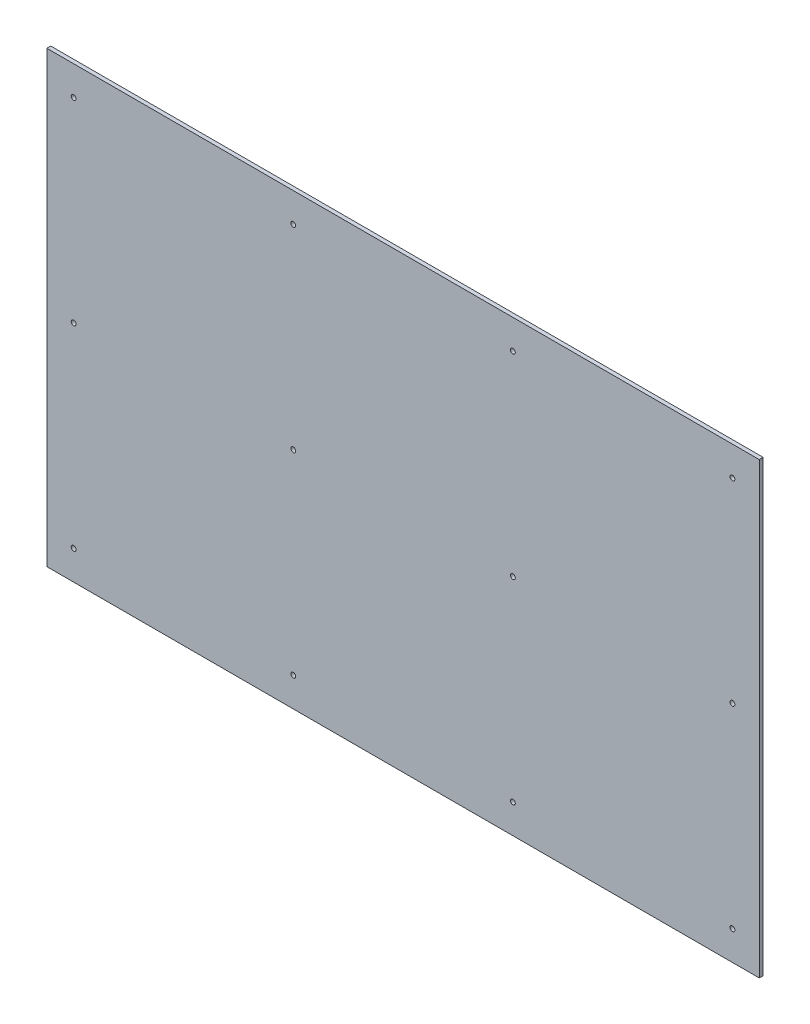
ISO-10303-21;
HEADER;
FILE_DESCRIPTION(('STEP AP214'),'2;1');
FILE_NAME('part.step','',(''),(''),'','','');
FILE_SCHEMA(('AUTOMOTIVE_DESIGN { 1 0 10303 214 1 1 1 1 }'));
ENDSEC;
DATA;
#1=APPLICATION_CONTEXT('core data for automotive mechanical design processes');
#2=APPLICATION_PROTOCOL_DEFINITION('international standard','automotive_design',2000,#1);
#3=PRODUCT_CONTEXT('',#1,'mechanical');
#4=PRODUCT('Part','Part','',(#3));
#5=PRODUCT_RELATED_PRODUCT_CATEGORY('part','',(#4));
#6=PRODUCT_DEFINITION_FORMATION('','',#4);
#7=PRODUCT_DEFINITION_CONTEXT('part definition',#1,'design');
#8=PRODUCT_DEFINITION('design','',#6,#7);
#9=PRODUCT_DEFINITION_SHAPE('','',#8);
#10=(LENGTH_UNIT() NAMED_UNIT(*) SI_UNIT(.MILLI.,.METRE.));
#11=(NAMED_UNIT(*) PLANE_ANGLE_UNIT() SI_UNIT($,.RADIAN.));
#12=(NAMED_UNIT(*) SI_UNIT($,.STERADIAN.) SOLID_ANGLE_UNIT());
#13=UNCERTAINTY_MEASURE_WITH_UNIT(LENGTH_MEASURE(1.E-05),#10,'distance_accuracy_value','');
#14=(GEOMETRIC_REPRESENTATION_CONTEXT(3) GLOBAL_UNCERTAINTY_ASSIGNED_CONTEXT((#13)) GLOBAL_UNIT_ASSIGNED_CONTEXT((#10,
#11,#12)) REPRESENTATION_CONTEXT('',''));
#15=CARTESIAN_POINT('',(0.,0.,0.));
#16=DIRECTION('',(0.,0.,1.));
#17=DIRECTION('',(1.,0.,0.));
#18=AXIS2_PLACEMENT_3D('',#15,#16,#17);
#19=CARTESIAN_POINT('',(2381.60107819692,2417.73780049663,-8.));
#20=DIRECTION('',(-1.,0.,0.));
#21=DIRECTION('',(0.,0.,1.));
#22=AXIS2_PLACEMENT_3D('',#19,#20,#21);
#23=PLANE('',#22);
#24=DIRECTION('',(0.,-1.,0.));
#25=VECTOR('',#24,1.);
#26=CARTESIAN_POINT('',(2381.60107819692,2417.73780049663,0.));
#27=LINE('',#26,#25);
#28=CARTESIAN_POINT('',(2381.60107819692,2417.73780049663,0.));
#29=VERTEX_POINT('',#28);
#30=CARTESIAN_POINT('',(2381.60107819692,1497.73780049663,0.));
#31=VERTEX_POINT('',#30);
#32=EDGE_CURVE('E103',#29,#31,#27,.T.);
#33=ORIENTED_EDGE('',*,*,#32,.F.);
#34=DIRECTION('',(0.,0.,1.));
#35=VECTOR('',#34,1.);
#36=CARTESIAN_POINT('',(2381.60107819692,2417.73780049663,-8.));
#37=LINE('',#36,#35);
#38=CARTESIAN_POINT('',(2381.60107819692,2417.73780049663,-8.));
#39=VERTEX_POINT('',#38);
#40=EDGE_CURVE('E11',#39,#29,#37,.T.);
#41=ORIENTED_EDGE('',*,*,#40,.F.);
#42=DIRECTION('',(0.,-1.,0.));
#43=VECTOR('',#42,1.);
#44=CARTESIAN_POINT('',(2381.60107819692,2417.73780049663,-8.));
#45=LINE('',#44,#43);
#46=CARTESIAN_POINT('',(2381.60107819692,1497.73780049663,-8.));
#47=VERTEX_POINT('',#46);
#48=EDGE_CURVE('E96',#39,#47,#45,.T.);
#49=ORIENTED_EDGE('',*,*,#48,.T.);
#50=DIRECTION('',(0.,0.,1.));
#51=VECTOR('',#50,1.);
#52=CARTESIAN_POINT('',(2381.60107819692,1497.73780049663,-8.));
#53=LINE('',#52,#51);
#54=EDGE_CURVE('E41',#47,#31,#53,.T.);
#55=ORIENTED_EDGE('',*,*,#54,.T.);
#56=EDGE_LOOP('',(#33,#41,#49,#55));
#57=FACE_BOUND('',#56,.T.);
#58=ADVANCED_FACE('F38',(#57),#23,.T.);
#59=CARTESIAN_POINT('',(3841.60107819692,2417.73780049663,-8.));
#60=DIRECTION('',(0.,1.,0.));
#61=DIRECTION('',(0.,0.,1.));
#62=AXIS2_PLACEMENT_3D('',#59,#60,#61);
#63=PLANE('',#62);
#64=DIRECTION('',(-1.,0.,0.));
#65=VECTOR('',#64,1.);
#66=CARTESIAN_POINT('',(3841.60107819692,2417.73780049663,0.));
#67=LINE('',#66,#65);
#68=CARTESIAN_POINT('',(3841.60107819692,2417.73780049663,0.));
#69=VERTEX_POINT('',#68);
#70=EDGE_CURVE('E98',#69,#29,#67,.T.);
#71=ORIENTED_EDGE('',*,*,#70,.F.);
#72=DIRECTION('',(0.,0.,1.));
#73=VECTOR('',#72,1.);
#74=CARTESIAN_POINT('',(3841.60107819692,2417.73780049663,-8.));
#75=LINE('',#74,#73);
#76=CARTESIAN_POINT('',(3841.60107819692,2417.73780049663,-8.));
#77=VERTEX_POINT('',#76);
#78=EDGE_CURVE('E47',#77,#69,#75,.T.);
#79=ORIENTED_EDGE('',*,*,#78,.F.);
#80=DIRECTION('',(-1.,0.,0.));
#81=VECTOR('',#80,1.);
#82=CARTESIAN_POINT('',(3841.60107819692,2417.73780049663,-8.));
#83=LINE('',#82,#81);
#84=EDGE_CURVE('E93',#77,#39,#83,.T.);
#85=ORIENTED_EDGE('',*,*,#84,.T.);
#86=ORIENTED_EDGE('',*,*,#40,.T.);
#87=EDGE_LOOP('',(#71,#79,#85,#86));
#88=FACE_BOUND('',#87,.T.);
#89=ADVANCED_FACE('F114',(#88),#63,.T.);
#90=CARTESIAN_POINT('',(3841.60107819692,1497.73780049663,-8.));
#91=DIRECTION('',(1.,0.,0.));
#92=DIRECTION('',(0.,0.,-1.));
#93=AXIS2_PLACEMENT_3D('',#90,#91,#92);
#94=PLANE('',#93);
#95=DIRECTION('',(0.,1.,0.));
#96=VECTOR('',#95,1.);
#97=CARTESIAN_POINT('',(3841.60107819692,1497.73780049663,0.));
#98=LINE('',#97,#96);
#99=CARTESIAN_POINT('',(3841.60107819692,1497.73780049663,0.));
#100=VERTEX_POINT('',#99);
#101=EDGE_CURVE('E88',#100,#69,#98,.T.);
#102=ORIENTED_EDGE('',*,*,#101,.F.);
#103=DIRECTION('',(0.,0.,1.));
#104=VECTOR('',#103,1.);
#105=CARTESIAN_POINT('',(3841.60107819692,1497.73780049663,-8.));
#106=LINE('',#105,#104);
#107=CARTESIAN_POINT('',(3841.60107819692,1497.73780049663,-8.));
#108=VERTEX_POINT('',#107);
#109=EDGE_CURVE('E83',#108,#100,#106,.T.);
#110=ORIENTED_EDGE('',*,*,#109,.F.);
#111=DIRECTION('',(0.,1.,0.));
#112=VECTOR('',#111,1.);
#113=CARTESIAN_POINT('',(3841.60107819692,1497.73780049663,-8.));
#114=LINE('',#113,#112);
#115=EDGE_CURVE('E86',#108,#77,#114,.T.);
#116=ORIENTED_EDGE('',*,*,#115,.T.);
#117=ORIENTED_EDGE('',*,*,#78,.T.);
#118=EDGE_LOOP('',(#102,#110,#116,#117));
#119=FACE_BOUND('',#118,.T.);
#120=ADVANCED_FACE('F85',(#119),#94,.T.);
#121=CARTESIAN_POINT('',(2381.60107819692,1497.73780049663,-8.));
#122=DIRECTION('',(0.,-1.,0.));
#123=DIRECTION('',(0.,0.,-1.));
#124=AXIS2_PLACEMENT_3D('',#121,#122,#123);
#125=PLANE('',#124);
#126=DIRECTION('',(1.,0.,0.));
#127=VECTOR('',#126,1.);
#128=CARTESIAN_POINT('',(2381.60107819692,1497.73780049663,0.));
#129=LINE('',#128,#127);
#130=EDGE_CURVE('E106',#31,#100,#129,.T.);
#131=ORIENTED_EDGE('',*,*,#130,.F.);
#132=ORIENTED_EDGE('',*,*,#54,.F.);
#133=DIRECTION('',(1.,0.,0.));
#134=VECTOR('',#133,1.);
#135=CARTESIAN_POINT('',(2381.60107819692,1497.73780049663,-8.));
#136=LINE('',#135,#134);
#137=EDGE_CURVE('E92',#47,#108,#136,.T.);
#138=ORIENTED_EDGE('',*,*,#137,.T.);
#139=ORIENTED_EDGE('',*,*,#109,.T.);
#140=EDGE_LOOP('',(#131,#132,#138,#139));
#141=FACE_BOUND('',#140,.T.);
#142=ADVANCED_FACE('F95',(#141),#125,.T.);
#143=CARTESIAN_POINT('',(0.,0.,-8.));
#144=DIRECTION('',(0.,0.,1.));
#145=DIRECTION('',(1.,0.,0.));
#146=AXIS2_PLACEMENT_3D('',#143,#144,#145);
#147=PLANE('',#146);
#148=CARTESIAN_POINT('',(3786.60107819692,1557.73780049663,-8.));
#149=DIRECTION('',(0.,0.,1.));
#150=DIRECTION('',(1.,0.,0.));
#151=AXIS2_PLACEMENT_3D('',#148,#149,#150);
#152=CIRCLE('',#151,4.99999999999989);
#153=CARTESIAN_POINT('',(3791.60107819692,1557.73780049663,-8.));
#154=VERTEX_POINT('',#153);
#155=EDGE_CURVE('E187',#154,#154,#152,.T.);
#156=ORIENTED_EDGE('',*,*,#155,.T.);
#157=EDGE_LOOP('',(#156));
#158=FACE_BOUND('',#157,.T.);
#159=CARTESIAN_POINT('',(3336.60107819692,1557.73780049663,-8.));
#160=DIRECTION('',(0.,0.,1.));
#161=DIRECTION('',(1.,0.,0.));
#162=AXIS2_PLACEMENT_3D('',#159,#160,#161);
#163=CIRCLE('',#162,4.99999999999989);
#164=CARTESIAN_POINT('',(3341.60107819692,1557.73780049663,-8.));
#165=VERTEX_POINT('',#164);
#166=EDGE_CURVE('E195',#165,#165,#163,.T.);
#167=ORIENTED_EDGE('',*,*,#166,.T.);
#168=EDGE_LOOP('',(#167));
#169=FACE_BOUND('',#168,.T.);
#170=CARTESIAN_POINT('',(2886.60107819692,1557.73780049663,-8.));
#171=DIRECTION('',(0.,0.,1.));
#172=DIRECTION('',(1.,0.,0.));
#173=AXIS2_PLACEMENT_3D('',#170,#171,#172);
#174=CIRCLE('',#173,4.99999999999989);
#175=CARTESIAN_POINT('',(2891.60107819692,1557.73780049663,-8.));
#176=VERTEX_POINT('',#175);
#177=EDGE_CURVE('E201',#176,#176,#174,.T.);
#178=ORIENTED_EDGE('',*,*,#177,.T.);
#179=EDGE_LOOP('',(#178));
#180=FACE_BOUND('',#179,.T.);
#181=CARTESIAN_POINT('',(2436.60107819692,1557.73780049663,-8.));
#182=DIRECTION('',(0.,0.,1.));
#183=DIRECTION('',(1.,0.,0.));
#184=AXIS2_PLACEMENT_3D('',#181,#182,#183);
#185=CIRCLE('',#184,4.99999999999989);
#186=CARTESIAN_POINT('',(2441.60107819692,1557.73780049663,-8.));
#187=VERTEX_POINT('',#186);
#188=EDGE_CURVE('E207',#187,#187,#185,.T.);
#189=ORIENTED_EDGE('',*,*,#188,.T.);
#190=EDGE_LOOP('',(#189));
#191=FACE_BOUND('',#190,.T.);
#192=CARTESIAN_POINT('',(3786.60107819692,1957.73780049663,-8.));
#193=DIRECTION('',(0.,0.,1.));
#194=DIRECTION('',(1.,0.,0.));
#195=AXIS2_PLACEMENT_3D('',#192,#193,#194);
#196=CIRCLE('',#195,4.99999999999989);
#197=CARTESIAN_POINT('',(3791.60107819692,1957.73780049663,-8.));
#198=VERTEX_POINT('',#197);
#199=EDGE_CURVE('E213',#198,#198,#196,.T.);
#200=ORIENTED_EDGE('',*,*,#199,.T.);
#201=EDGE_LOOP('',(#200));
#202=FACE_BOUND('',#201,.T.);
#203=CARTESIAN_POINT('',(3336.60107819692,1957.73780049663,-8.));
#204=DIRECTION('',(0.,0.,1.));
#205=DIRECTION('',(1.,0.,0.));
#206=AXIS2_PLACEMENT_3D('',#203,#204,#205);
#207=CIRCLE('',#206,4.99999999999989);
#208=CARTESIAN_POINT('',(3341.60107819692,1957.73780049663,-8.));
#209=VERTEX_POINT('',#208);
#210=EDGE_CURVE('E219',#209,#209,#207,.T.);
#211=ORIENTED_EDGE('',*,*,#210,.T.);
#212=EDGE_LOOP('',(#211));
#213=FACE_BOUND('',#212,.T.);
#214=CARTESIAN_POINT('',(2886.60107819692,1957.73780049663,-8.));
#215=DIRECTION('',(0.,0.,1.));
#216=DIRECTION('',(1.,0.,0.));
#217=AXIS2_PLACEMENT_3D('',#214,#215,#216);
#218=CIRCLE('',#217,4.99999999999989);
#219=CARTESIAN_POINT('',(2891.60107819692,1957.73780049663,-8.));
#220=VERTEX_POINT('',#219);
#221=EDGE_CURVE('E225',#220,#220,#218,.T.);
#222=ORIENTED_EDGE('',*,*,#221,.T.);
#223=EDGE_LOOP('',(#222));
#224=FACE_BOUND('',#223,.T.);
#225=CARTESIAN_POINT('',(2436.60107819692,1957.73780049663,-8.));
#226=DIRECTION('',(0.,0.,1.));
#227=DIRECTION('',(1.,0.,0.));
#228=AXIS2_PLACEMENT_3D('',#225,#226,#227);
#229=CIRCLE('',#228,4.99999999999989);
#230=CARTESIAN_POINT('',(2441.60107819692,1957.73780049663,-8.));
#231=VERTEX_POINT('',#230);
#232=EDGE_CURVE('E231',#231,#231,#229,.T.);
#233=ORIENTED_EDGE('',*,*,#232,.T.);
#234=EDGE_LOOP('',(#233));
#235=FACE_BOUND('',#234,.T.);
#236=CARTESIAN_POINT('',(3786.60107819692,2357.73780049663,-8.));
#237=DIRECTION('',(0.,0.,1.));
#238=DIRECTION('',(1.,0.,0.));
#239=AXIS2_PLACEMENT_3D('',#236,#237,#238);
#240=CIRCLE('',#239,4.99999999999989);
#241=CARTESIAN_POINT('',(3791.60107819692,2357.73780049663,-8.));
#242=VERTEX_POINT('',#241);
#243=EDGE_CURVE('E237',#242,#242,#240,.T.);
#244=ORIENTED_EDGE('',*,*,#243,.T.);
#245=EDGE_LOOP('',(#244));
#246=FACE_BOUND('',#245,.T.);
#247=CARTESIAN_POINT('',(3336.60107819692,2357.73780049663,-8.));
#248=DIRECTION('',(0.,0.,1.));
#249=DIRECTION('',(1.,0.,0.));
#250=AXIS2_PLACEMENT_3D('',#247,#248,#249);
#251=CIRCLE('',#250,4.99999999999989);
#252=CARTESIAN_POINT('',(3341.60107819692,2357.73780049663,-8.));
#253=VERTEX_POINT('',#252);
#254=EDGE_CURVE('E243',#253,#253,#251,.T.);
#255=ORIENTED_EDGE('',*,*,#254,.T.);
#256=EDGE_LOOP('',(#255));
#257=FACE_BOUND('',#256,.T.);
#258=CARTESIAN_POINT('',(2886.60107819692,2357.73780049663,-8.));
#259=DIRECTION('',(0.,0.,1.));
#260=DIRECTION('',(1.,0.,0.));
#261=AXIS2_PLACEMENT_3D('',#258,#259,#260);
#262=CIRCLE('',#261,4.99999999999989);
#263=CARTESIAN_POINT('',(2891.60107819692,2357.73780049663,-8.));
#264=VERTEX_POINT('',#263);
#265=EDGE_CURVE('E249',#264,#264,#262,.T.);
#266=ORIENTED_EDGE('',*,*,#265,.T.);
#267=EDGE_LOOP('',(#266));
#268=FACE_BOUND('',#267,.T.);
#269=CARTESIAN_POINT('',(2436.60107819692,2357.73780049663,-8.));
#270=DIRECTION('',(0.,0.,1.));
#271=DIRECTION('',(1.,0.,0.));
#272=AXIS2_PLACEMENT_3D('',#269,#270,#271);
#273=CIRCLE('',#272,4.99999999999989);
#274=CARTESIAN_POINT('',(2441.60107819692,2357.73780049663,-8.));
#275=VERTEX_POINT('',#274);
#276=EDGE_CURVE('E107',#275,#275,#273,.T.);
#277=ORIENTED_EDGE('',*,*,#276,.T.);
#278=EDGE_LOOP('',(#277));
#279=FACE_BOUND('',#278,.T.);
#280=ORIENTED_EDGE('',*,*,#48,.F.);
#281=ORIENTED_EDGE('',*,*,#84,.F.);
#282=ORIENTED_EDGE('',*,*,#115,.F.);
#283=ORIENTED_EDGE('',*,*,#137,.F.);
#284=EDGE_LOOP('',(#280,#281,#282,#283));
#285=FACE_BOUND('',#284,.T.);
#286=ADVANCED_FACE('F91',(#158,#169,#180,#191,#202,#213,#224,#235,#246,#257,#268,#279,#285),
#147,.F.);
#287=CARTESIAN_POINT('',(0.,0.,0.));
#288=DIRECTION('',(0.,0.,1.));
#289=DIRECTION('',(1.,0.,0.));
#290=AXIS2_PLACEMENT_3D('',#287,#288,#289);
#291=PLANE('',#290);
#292=CARTESIAN_POINT('',(3786.60107819692,1557.73780049663,0.));
#293=DIRECTION('',(0.,0.,1.));
#294=DIRECTION('',(1.,0.,0.));
#295=AXIS2_PLACEMENT_3D('',#292,#293,#294);
#296=CIRCLE('',#295,4.99999999999989);
#297=CARTESIAN_POINT('',(3791.60107819692,1557.73780049663,0.));
#298=VERTEX_POINT('',#297);
#299=EDGE_CURVE('E190',#298,#298,#296,.T.);
#300=ORIENTED_EDGE('',*,*,#299,.F.);
#301=EDGE_LOOP('',(#300));
#302=FACE_BOUND('',#301,.T.);
#303=CARTESIAN_POINT('',(3336.60107819692,1557.73780049663,0.));
#304=DIRECTION('',(0.,0.,1.));
#305=DIRECTION('',(1.,0.,0.));
#306=AXIS2_PLACEMENT_3D('',#303,#304,#305);
#307=CIRCLE('',#306,4.99999999999989);
#308=CARTESIAN_POINT('',(3341.60107819692,1557.73780049663,0.));
#309=VERTEX_POINT('',#308);
#310=EDGE_CURVE('E192',#309,#309,#307,.T.);
#311=ORIENTED_EDGE('',*,*,#310,.F.);
#312=EDGE_LOOP('',(#311));
#313=FACE_BOUND('',#312,.T.);
#314=CARTESIAN_POINT('',(2886.60107819692,1557.73780049663,0.));
#315=DIRECTION('',(0.,0.,1.));
#316=DIRECTION('',(1.,0.,0.));
#317=AXIS2_PLACEMENT_3D('',#314,#315,#316);
#318=CIRCLE('',#317,4.99999999999989);
#319=CARTESIAN_POINT('',(2891.60107819692,1557.73780049663,0.));
#320=VERTEX_POINT('',#319);
#321=EDGE_CURVE('E198',#320,#320,#318,.T.);
#322=ORIENTED_EDGE('',*,*,#321,.F.);
#323=EDGE_LOOP('',(#322));
#324=FACE_BOUND('',#323,.T.);
#325=CARTESIAN_POINT('',(2436.60107819692,1557.73780049663,0.));
#326=DIRECTION('',(0.,0.,1.));
#327=DIRECTION('',(1.,0.,0.));
#328=AXIS2_PLACEMENT_3D('',#325,#326,#327);
#329=CIRCLE('',#328,4.99999999999989);
#330=CARTESIAN_POINT('',(2441.60107819692,1557.73780049663,0.));
#331=VERTEX_POINT('',#330);
#332=EDGE_CURVE('E204',#331,#331,#329,.T.);
#333=ORIENTED_EDGE('',*,*,#332,.F.);
#334=EDGE_LOOP('',(#333));
#335=FACE_BOUND('',#334,.T.);
#336=CARTESIAN_POINT('',(3786.60107819692,1957.73780049663,0.));
#337=DIRECTION('',(0.,0.,1.));
#338=DIRECTION('',(1.,0.,0.));
#339=AXIS2_PLACEMENT_3D('',#336,#337,#338);
#340=CIRCLE('',#339,4.99999999999989);
#341=CARTESIAN_POINT('',(3791.60107819692,1957.73780049663,0.));
#342=VERTEX_POINT('',#341);
#343=EDGE_CURVE('E210',#342,#342,#340,.T.);
#344=ORIENTED_EDGE('',*,*,#343,.F.);
#345=EDGE_LOOP('',(#344));
#346=FACE_BOUND('',#345,.T.);
#347=CARTESIAN_POINT('',(3336.60107819692,1957.73780049663,0.));
#348=DIRECTION('',(0.,0.,1.));
#349=DIRECTION('',(1.,0.,0.));
#350=AXIS2_PLACEMENT_3D('',#347,#348,#349);
#351=CIRCLE('',#350,4.99999999999989);
#352=CARTESIAN_POINT('',(3341.60107819692,1957.73780049663,0.));
#353=VERTEX_POINT('',#352);
#354=EDGE_CURVE('E216',#353,#353,#351,.T.);
#355=ORIENTED_EDGE('',*,*,#354,.F.);
#356=EDGE_LOOP('',(#355));
#357=FACE_BOUND('',#356,.T.);
#358=CARTESIAN_POINT('',(2886.60107819692,1957.73780049663,0.));
#359=DIRECTION('',(0.,0.,1.));
#360=DIRECTION('',(1.,0.,0.));
#361=AXIS2_PLACEMENT_3D('',#358,#359,#360);
#362=CIRCLE('',#361,4.99999999999989);
#363=CARTESIAN_POINT('',(2891.60107819692,1957.73780049663,0.));
#364=VERTEX_POINT('',#363);
#365=EDGE_CURVE('E222',#364,#364,#362,.T.);
#366=ORIENTED_EDGE('',*,*,#365,.F.);
#367=EDGE_LOOP('',(#366));
#368=FACE_BOUND('',#367,.T.);
#369=CARTESIAN_POINT('',(2436.60107819692,1957.73780049663,0.));
#370=DIRECTION('',(0.,0.,1.));
#371=DIRECTION('',(1.,0.,0.));
#372=AXIS2_PLACEMENT_3D('',#369,#370,#371);
#373=CIRCLE('',#372,4.99999999999989);
#374=CARTESIAN_POINT('',(2441.60107819692,1957.73780049663,0.));
#375=VERTEX_POINT('',#374);
#376=EDGE_CURVE('E228',#375,#375,#373,.T.);
#377=ORIENTED_EDGE('',*,*,#376,.F.);
#378=EDGE_LOOP('',(#377));
#379=FACE_BOUND('',#378,.T.);
#380=CARTESIAN_POINT('',(3786.60107819692,2357.73780049663,0.));
#381=DIRECTION('',(0.,0.,1.));
#382=DIRECTION('',(1.,0.,0.));
#383=AXIS2_PLACEMENT_3D('',#380,#381,#382);
#384=CIRCLE('',#383,4.99999999999989);
#385=CARTESIAN_POINT('',(3791.60107819692,2357.73780049663,0.));
#386=VERTEX_POINT('',#385);
#387=EDGE_CURVE('E234',#386,#386,#384,.T.);
#388=ORIENTED_EDGE('',*,*,#387,.F.);
#389=EDGE_LOOP('',(#388));
#390=FACE_BOUND('',#389,.T.);
#391=CARTESIAN_POINT('',(3336.60107819692,2357.73780049663,0.));
#392=DIRECTION('',(0.,0.,1.));
#393=DIRECTION('',(1.,0.,0.));
#394=AXIS2_PLACEMENT_3D('',#391,#392,#393);
#395=CIRCLE('',#394,4.99999999999989);
#396=CARTESIAN_POINT('',(3341.60107819692,2357.73780049663,0.));
#397=VERTEX_POINT('',#396);
#398=EDGE_CURVE('E240',#397,#397,#395,.T.);
#399=ORIENTED_EDGE('',*,*,#398,.F.);
#400=EDGE_LOOP('',(#399));
#401=FACE_BOUND('',#400,.T.);
#402=CARTESIAN_POINT('',(2886.60107819692,2357.73780049663,0.));
#403=DIRECTION('',(0.,0.,1.));
#404=DIRECTION('',(1.,0.,0.));
#405=AXIS2_PLACEMENT_3D('',#402,#403,#404);
#406=CIRCLE('',#405,4.99999999999989);
#407=CARTESIAN_POINT('',(2891.60107819692,2357.73780049663,0.));
#408=VERTEX_POINT('',#407);
#409=EDGE_CURVE('E246',#408,#408,#406,.T.);
#410=ORIENTED_EDGE('',*,*,#409,.F.);
#411=EDGE_LOOP('',(#410));
#412=FACE_BOUND('',#411,.T.);
#413=CARTESIAN_POINT('',(2436.60107819692,2357.73780049663,0.));
#414=DIRECTION('',(0.,0.,1.));
#415=DIRECTION('',(1.,0.,0.));
#416=AXIS2_PLACEMENT_3D('',#413,#414,#415);
#417=CIRCLE('',#416,4.99999999999989);
#418=CARTESIAN_POINT('',(2441.60107819692,2357.73780049663,0.));
#419=VERTEX_POINT('',#418);
#420=EDGE_CURVE('E252',#419,#419,#417,.T.);
#421=ORIENTED_EDGE('',*,*,#420,.F.);
#422=EDGE_LOOP('',(#421));
#423=FACE_BOUND('',#422,.T.);
#424=ORIENTED_EDGE('',*,*,#32,.T.);
#425=ORIENTED_EDGE('',*,*,#130,.T.);
#426=ORIENTED_EDGE('',*,*,#101,.T.);
#427=ORIENTED_EDGE('',*,*,#70,.T.);
#428=EDGE_LOOP('',(#424,#425,#426,#427));
#429=FACE_BOUND('',#428,.T.);
#430=ADVANCED_FACE('F113',(#302,#313,#324,#335,#346,#357,#368,#379,#390,#401,#412,#423,#429),
#291,.T.);
#431=CARTESIAN_POINT('',(2436.60107819692,2357.73780049663,-8.));
#432=DIRECTION('',(0.,0.,1.));
#433=DIRECTION('',(1.,0.,0.));
#434=AXIS2_PLACEMENT_3D('',#431,#432,#433);
#435=CYLINDRICAL_SURFACE('',#434,4.99999999999989);
#436=ORIENTED_EDGE('',*,*,#276,.F.);
#437=EDGE_LOOP('',(#436));
#438=FACE_BOUND('',#437,.T.);
#439=ORIENTED_EDGE('',*,*,#420,.T.);
#440=EDGE_LOOP('',(#439));
#441=FACE_BOUND('',#440,.T.);
#442=ADVANCED_FACE('F132',(#438,#441),#435,.F.);
#443=CARTESIAN_POINT('',(2886.60107819692,2357.73780049663,-8.));
#444=DIRECTION('',(0.,0.,1.));
#445=DIRECTION('',(1.,0.,0.));
#446=AXIS2_PLACEMENT_3D('',#443,#444,#445);
#447=CYLINDRICAL_SURFACE('',#446,4.99999999999989);
#448=ORIENTED_EDGE('',*,*,#265,.F.);
#449=EDGE_LOOP('',(#448));
#450=FACE_BOUND('',#449,.T.);
#451=ORIENTED_EDGE('',*,*,#409,.T.);
#452=EDGE_LOOP('',(#451));
#453=FACE_BOUND('',#452,.T.);
#454=ADVANCED_FACE('F139',(#450,#453),#447,.F.);
#455=CARTESIAN_POINT('',(3336.60107819692,2357.73780049663,-8.));
#456=DIRECTION('',(0.,0.,1.));
#457=DIRECTION('',(1.,0.,0.));
#458=AXIS2_PLACEMENT_3D('',#455,#456,#457);
#459=CYLINDRICAL_SURFACE('',#458,4.99999999999989);
#460=ORIENTED_EDGE('',*,*,#254,.F.);
#461=EDGE_LOOP('',(#460));
#462=FACE_BOUND('',#461,.T.);
#463=ORIENTED_EDGE('',*,*,#398,.T.);
#464=EDGE_LOOP('',(#463));
#465=FACE_BOUND('',#464,.T.);
#466=ADVANCED_FACE('F143',(#462,#465),#459,.F.);
#467=CARTESIAN_POINT('',(3786.60107819692,2357.73780049663,-8.));
#468=DIRECTION('',(0.,0.,1.));
#469=DIRECTION('',(1.,0.,0.));
#470=AXIS2_PLACEMENT_3D('',#467,#468,#469);
#471=CYLINDRICAL_SURFACE('',#470,4.99999999999989);
#472=ORIENTED_EDGE('',*,*,#243,.F.);
#473=EDGE_LOOP('',(#472));
#474=FACE_BOUND('',#473,.T.);
#475=ORIENTED_EDGE('',*,*,#387,.T.);
#476=EDGE_LOOP('',(#475));
#477=FACE_BOUND('',#476,.T.);
#478=ADVANCED_FACE('F147',(#474,#477),#471,.F.);
#479=CARTESIAN_POINT('',(2436.60107819692,1957.73780049663,-8.));
#480=DIRECTION('',(0.,0.,1.));
#481=DIRECTION('',(1.,0.,0.));
#482=AXIS2_PLACEMENT_3D('',#479,#480,#481);
#483=CYLINDRICAL_SURFACE('',#482,4.99999999999989);
#484=ORIENTED_EDGE('',*,*,#232,.F.);
#485=EDGE_LOOP('',(#484));
#486=FACE_BOUND('',#485,.T.);
#487=ORIENTED_EDGE('',*,*,#376,.T.);
#488=EDGE_LOOP('',(#487));
#489=FACE_BOUND('',#488,.T.);
#490=ADVANCED_FACE('F151',(#486,#489),#483,.F.);
#491=CARTESIAN_POINT('',(2886.60107819692,1957.73780049663,-8.));
#492=DIRECTION('',(0.,0.,1.));
#493=DIRECTION('',(1.,0.,0.));
#494=AXIS2_PLACEMENT_3D('',#491,#492,#493);
#495=CYLINDRICAL_SURFACE('',#494,4.99999999999989);
#496=ORIENTED_EDGE('',*,*,#221,.F.);
#497=EDGE_LOOP('',(#496));
#498=FACE_BOUND('',#497,.T.);
#499=ORIENTED_EDGE('',*,*,#365,.T.);
#500=EDGE_LOOP('',(#499));
#501=FACE_BOUND('',#500,.T.);
#502=ADVANCED_FACE('F155',(#498,#501),#495,.F.);
#503=CARTESIAN_POINT('',(3336.60107819692,1957.73780049663,-8.));
#504=DIRECTION('',(0.,0.,1.));
#505=DIRECTION('',(1.,0.,0.));
#506=AXIS2_PLACEMENT_3D('',#503,#504,#505);
#507=CYLINDRICAL_SURFACE('',#506,4.99999999999989);
#508=ORIENTED_EDGE('',*,*,#210,.F.);
#509=EDGE_LOOP('',(#508));
#510=FACE_BOUND('',#509,.T.);
#511=ORIENTED_EDGE('',*,*,#354,.T.);
#512=EDGE_LOOP('',(#511));
#513=FACE_BOUND('',#512,.T.);
#514=ADVANCED_FACE('F159',(#510,#513),#507,.F.);
#515=CARTESIAN_POINT('',(3786.60107819692,1957.73780049663,-8.));
#516=DIRECTION('',(0.,0.,1.));
#517=DIRECTION('',(1.,0.,0.));
#518=AXIS2_PLACEMENT_3D('',#515,#516,#517);
#519=CYLINDRICAL_SURFACE('',#518,4.99999999999989);
#520=ORIENTED_EDGE('',*,*,#199,.F.);
#521=EDGE_LOOP('',(#520));
#522=FACE_BOUND('',#521,.T.);
#523=ORIENTED_EDGE('',*,*,#343,.T.);
#524=EDGE_LOOP('',(#523));
#525=FACE_BOUND('',#524,.T.);
#526=ADVANCED_FACE('F163',(#522,#525),#519,.F.);
#527=CARTESIAN_POINT('',(2436.60107819692,1557.73780049663,-8.));
#528=DIRECTION('',(0.,0.,1.));
#529=DIRECTION('',(1.,0.,0.));
#530=AXIS2_PLACEMENT_3D('',#527,#528,#529);
#531=CYLINDRICAL_SURFACE('',#530,4.99999999999989);
#532=ORIENTED_EDGE('',*,*,#188,.F.);
#533=EDGE_LOOP('',(#532));
#534=FACE_BOUND('',#533,.T.);
#535=ORIENTED_EDGE('',*,*,#332,.T.);
#536=EDGE_LOOP('',(#535));
#537=FACE_BOUND('',#536,.T.);
#538=ADVANCED_FACE('F167',(#534,#537),#531,.F.);
#539=CARTESIAN_POINT('',(2886.60107819692,1557.73780049663,-8.));
#540=DIRECTION('',(0.,0.,1.));
#541=DIRECTION('',(1.,0.,0.));
#542=AXIS2_PLACEMENT_3D('',#539,#540,#541);
#543=CYLINDRICAL_SURFACE('',#542,4.99999999999989);
#544=ORIENTED_EDGE('',*,*,#177,.F.);
#545=EDGE_LOOP('',(#544));
#546=FACE_BOUND('',#545,.T.);
#547=ORIENTED_EDGE('',*,*,#321,.T.);
#548=EDGE_LOOP('',(#547));
#549=FACE_BOUND('',#548,.T.);
#550=ADVANCED_FACE('F171',(#546,#549),#543,.F.);
#551=CARTESIAN_POINT('',(3336.60107819692,1557.73780049663,-8.));
#552=DIRECTION('',(0.,0.,1.));
#553=DIRECTION('',(1.,0.,0.));
#554=AXIS2_PLACEMENT_3D('',#551,#552,#553);
#555=CYLINDRICAL_SURFACE('',#554,4.99999999999989);
#556=ORIENTED_EDGE('',*,*,#166,.F.);
#557=EDGE_LOOP('',(#556));
#558=FACE_BOUND('',#557,.T.);
#559=ORIENTED_EDGE('',*,*,#310,.T.);
#560=EDGE_LOOP('',(#559));
#561=FACE_BOUND('',#560,.T.);
#562=ADVANCED_FACE('F175',(#558,#561),#555,.F.);
#563=CARTESIAN_POINT('',(3786.60107819692,1557.73780049663,-8.));
#564=DIRECTION('',(0.,0.,1.));
#565=DIRECTION('',(1.,0.,0.));
#566=AXIS2_PLACEMENT_3D('',#563,#564,#565);
#567=CYLINDRICAL_SURFACE('',#566,4.99999999999989);
#568=ORIENTED_EDGE('',*,*,#155,.F.);
#569=EDGE_LOOP('',(#568));
#570=FACE_BOUND('',#569,.T.);
#571=ORIENTED_EDGE('',*,*,#299,.T.);
#572=EDGE_LOOP('',(#571));
#573=FACE_BOUND('',#572,.T.);
#574=ADVANCED_FACE('F179',(#570,#573),#567,.F.);
#575=CLOSED_SHELL('',(#58,#89,#120,#142,#286,#430,#442,#454,#466,#478,#490,#502,#514,#526,#538,
#550,#562,#574));
#576=MANIFOLD_SOLID_BREP('B2',#575);
#577=ADVANCED_BREP_SHAPE_REPRESENTATION('',(#18,#576),#14);
#578=SHAPE_DEFINITION_REPRESENTATION(#9,#577);
ENDSEC;
END-ISO-10303-21;
